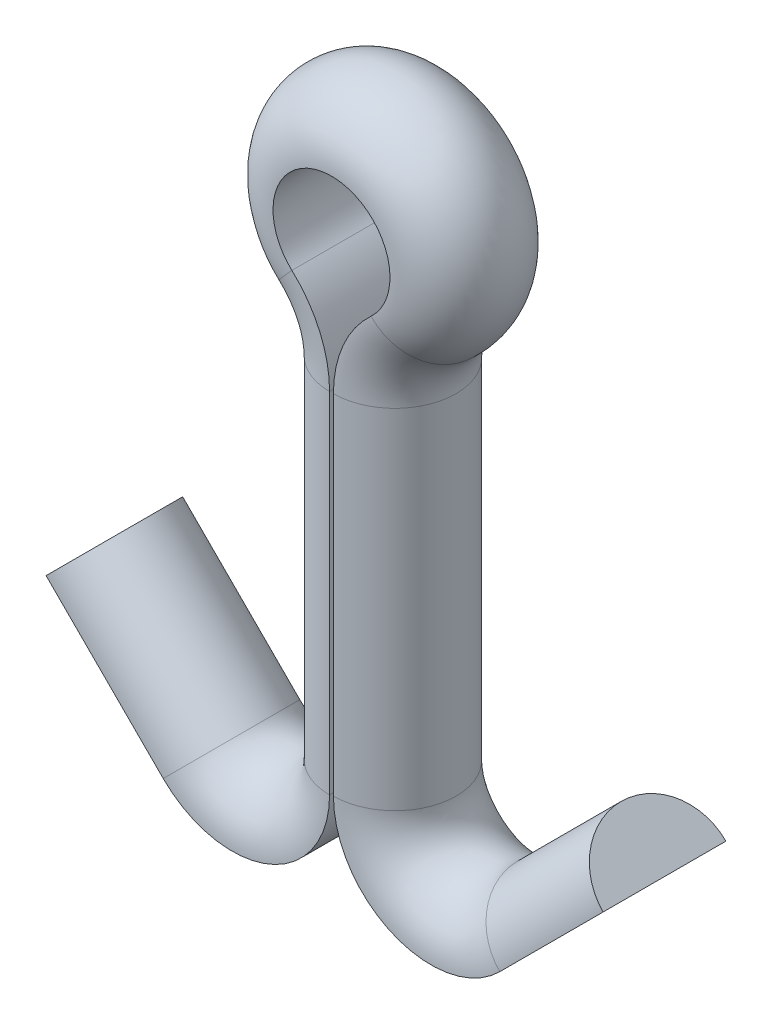
ISO-10303-21;
HEADER;
FILE_DESCRIPTION(('STEP AP214'),'2;1');
FILE_NAME('part.step','',(''),(''),'','','');
FILE_SCHEMA(('AUTOMOTIVE_DESIGN { 1 0 10303 214 1 1 1 1 }'));
ENDSEC;
DATA;
#1=APPLICATION_CONTEXT('core data for automotive mechanical design processes');
#2=APPLICATION_PROTOCOL_DEFINITION('international standard','automotive_design',2000,#1);
#3=PRODUCT_CONTEXT('',#1,'mechanical');
#4=PRODUCT('Part','Part','',(#3));
#5=PRODUCT_RELATED_PRODUCT_CATEGORY('part','',(#4));
#6=PRODUCT_DEFINITION_FORMATION('','',#4);
#7=PRODUCT_DEFINITION_CONTEXT('part definition',#1,'design');
#8=PRODUCT_DEFINITION('design','',#6,#7);
#9=PRODUCT_DEFINITION_SHAPE('','',#8);
#10=(LENGTH_UNIT() NAMED_UNIT(*) SI_UNIT(.MILLI.,.METRE.));
#11=(NAMED_UNIT(*) PLANE_ANGLE_UNIT() SI_UNIT($,.RADIAN.));
#12=(NAMED_UNIT(*) SI_UNIT($,.STERADIAN.) SOLID_ANGLE_UNIT());
#13=UNCERTAINTY_MEASURE_WITH_UNIT(LENGTH_MEASURE(1.E-05),#10,'distance_accuracy_value','');
#14=(GEOMETRIC_REPRESENTATION_CONTEXT(3) GLOBAL_UNCERTAINTY_ASSIGNED_CONTEXT((#13)) GLOBAL_UNIT_ASSIGNED_CONTEXT((#10,
#11,#12)) REPRESENTATION_CONTEXT('',''));
#15=CARTESIAN_POINT('',(0.,0.,0.));
#16=DIRECTION('',(0.,0.,1.));
#17=DIRECTION('',(1.,0.,0.));
#18=AXIS2_PLACEMENT_3D('',#15,#16,#17);
#19=CARTESIAN_POINT('',(-2.19302561210693,-7.1337256121069,0.8001));
#20=DIRECTION('',(0.707106781186551,0.707106781186544,0.));
#21=DIRECTION('',(-0.707106781186544,0.707106781186551,0.));
#22=AXIS2_PLACEMENT_3D('',#19,#20,#21);
#23=PLANE('',#22);
#24=DIRECTION('',(0.,0.,-1.));
#25=VECTOR('',#24,1.);
#26=CARTESIAN_POINT('',(-2.19302561210693,-7.1337256121069,0.8001));
#27=LINE('',#26,#25);
#28=CARTESIAN_POINT('',(-2.19302561210693,-7.1337256121069,0.8001));
#29=VERTEX_POINT('',#28);
#30=CARTESIAN_POINT('',(-2.19302561210693,-7.1337256121069,-0.8001));
#31=VERTEX_POINT('',#30);
#32=EDGE_CURVE('E198',#29,#31,#27,.T.);
#33=ORIENTED_EDGE('',*,*,#32,.F.);
#34=DIRECTION('',(-0.707106781186544,0.707106781186551,0.));
#35=VECTOR('',#34,1.);
#36=CARTESIAN_POINT('',(-2.19302561210693,-7.1337256121069,0.8001));
#37=LINE('',#36,#35);
#38=CARTESIAN_POINT('',(-3.71966915268867,-5.60708207152514,0.8001));
#39=VERTEX_POINT('',#38);
#40=EDGE_CURVE('E38',#29,#39,#37,.T.);
#41=ORIENTED_EDGE('',*,*,#40,.T.);
#42=DIRECTION('',(0.,0.,-1.));
#43=VECTOR('',#42,1.);
#44=CARTESIAN_POINT('',(-3.71966915268867,-5.60708207152514,0.8001));
#45=LINE('',#44,#43);
#46=CARTESIAN_POINT('',(-3.71966915268867,-5.60708207152514,-0.8001));
#47=VERTEX_POINT('',#46);
#48=EDGE_CURVE('E45',#39,#47,#45,.T.);
#49=ORIENTED_EDGE('',*,*,#48,.T.);
#50=DIRECTION('',(-0.707106781186544,0.707106781186551,0.));
#51=VECTOR('',#50,1.);
#52=CARTESIAN_POINT('',(-2.19302561210693,-7.1337256121069,-0.8001));
#53=LINE('',#52,#51);
#54=EDGE_CURVE('E11',#31,#47,#53,.T.);
#55=ORIENTED_EDGE('',*,*,#54,.F.);
#56=EDGE_LOOP('',(#33,#41,#49,#55));
#57=FACE_BOUND('',#56,.T.);
#58=ADVANCED_FACE('F31',(#57),#23,.F.);
#59=CARTESIAN_POINT('',(-2.19302561210693,-7.1337256121069,0.));
#60=DIRECTION('',(-0.707106781186544,0.707106781186551,0.));
#61=DIRECTION('',(-0.707106781186551,-0.707106781186544,0.));
#62=AXIS2_PLACEMENT_3D('',#59,#60,#61);
#63=CYLINDRICAL_SURFACE('',#62,0.8001);
#64=CARTESIAN_POINT('',(-2.19302561210693,-7.1337256121069,0.));
#65=DIRECTION('',(-0.707106781186554,0.707106781186541,0.));
#66=DIRECTION('',(-0.707106781186541,-0.707106781186554,0.));
#67=AXIS2_PLACEMENT_3D('',#64,#65,#66);
#68=CIRCLE('',#67,0.8001);
#69=EDGE_CURVE('E195',#29,#31,#68,.T.);
#70=ORIENTED_EDGE('',*,*,#69,.T.);
#71=ORIENTED_EDGE('',*,*,#54,.T.);
#72=CARTESIAN_POINT('',(-3.71966915268868,-5.60708207152514,0.));
#73=DIRECTION('',(-0.707106781186554,0.707106781186541,0.));
#74=DIRECTION('',(-0.707106781186541,-0.707106781186554,0.));
#75=AXIS2_PLACEMENT_3D('',#72,#73,#74);
#76=CIRCLE('',#75,0.8001);
#77=EDGE_CURVE('E51',#39,#47,#76,.T.);
#78=ORIENTED_EDGE('',*,*,#77,.F.);
#79=ORIENTED_EDGE('',*,*,#40,.F.);
#80=EDGE_LOOP('',(#70,#71,#78,#79));
#81=FACE_BOUND('',#80,.T.);
#82=ADVANCED_FACE('F210',(#81),#63,.T.);
#83=CARTESIAN_POINT('',(-1.295,-6.2357,0.));
#84=DIRECTION('',(0.,0.,-1.));
#85=DIRECTION('',(-1.,0.,0.));
#86=AXIS2_PLACEMENT_3D('',#83,#84,#85);
#87=CYLINDRICAL_SURFACE('',#86,1.27);
#88=DIRECTION('',(0.,0.,-1.));
#89=VECTOR('',#88,1.);
#90=CARTESIAN_POINT('',(-0.0250000000000011,-6.23570000000001,0.8001));
#91=LINE('',#90,#89);
#92=CARTESIAN_POINT('',(-0.0250000000000011,-6.23570000000001,0.8001));
#93=VERTEX_POINT('',#92);
#94=CARTESIAN_POINT('',(-0.0250000000000011,-6.23570000000001,-0.8001));
#95=VERTEX_POINT('',#94);
#96=EDGE_CURVE('E186',#93,#95,#91,.T.);
#97=ORIENTED_EDGE('',*,*,#96,.F.);
#98=CARTESIAN_POINT('',(-1.295,-6.2357,0.8001));
#99=DIRECTION('',(0.,0.,-1.));
#100=DIRECTION('',(-1.,0.,0.));
#101=AXIS2_PLACEMENT_3D('',#98,#99,#100);
#102=CIRCLE('',#101,1.27);
#103=EDGE_CURVE('E201',#93,#29,#102,.T.);
#104=ORIENTED_EDGE('',*,*,#103,.T.);
#105=ORIENTED_EDGE('',*,*,#32,.T.);
#106=CARTESIAN_POINT('',(-1.295,-6.2357,-0.8001));
#107=DIRECTION('',(0.,0.,-1.));
#108=DIRECTION('',(-1.,0.,0.));
#109=AXIS2_PLACEMENT_3D('',#106,#107,#108);
#110=CIRCLE('',#109,1.27);
#111=EDGE_CURVE('E204',#95,#31,#110,.T.);
#112=ORIENTED_EDGE('',*,*,#111,.F.);
#113=EDGE_LOOP('',(#97,#104,#105,#112));
#114=FACE_BOUND('',#113,.T.);
#115=ADVANCED_FACE('F214',(#114),#87,.T.);
#116=CARTESIAN_POINT('',(-1.295,-6.2357,0.));
#117=DIRECTION('',(0.,0.,-1.));
#118=DIRECTION('',(-1.,0.,0.));
#119=AXIS2_PLACEMENT_3D('',#116,#117,#118);
#120=TOROIDAL_SURFACE('',#119,1.27,0.8001);
#121=CARTESIAN_POINT('',(-0.0250000000000009,-6.23570000000001,0.));
#122=DIRECTION('',(0.,-1.,0.));
#123=DIRECTION('',(1.,0.,0.));
#124=AXIS2_PLACEMENT_3D('',#121,#122,#123);
#125=CIRCLE('',#124,0.8001);
#126=EDGE_CURVE('E183',#93,#95,#125,.T.);
#127=ORIENTED_EDGE('',*,*,#126,.T.);
#128=ORIENTED_EDGE('',*,*,#111,.T.);
#129=ORIENTED_EDGE('',*,*,#69,.F.);
#130=ORIENTED_EDGE('',*,*,#103,.F.);
#131=EDGE_LOOP('',(#127,#128,#129,#130));
#132=FACE_BOUND('',#131,.T.);
#133=ADVANCED_FACE('F215',(#132),#120,.T.);
#134=CARTESIAN_POINT('',(-0.0250000000000005,-1.68118856765088,0.8001));
#135=DIRECTION('',(-1.,0.,0.));
#136=DIRECTION('',(0.,-1.,0.));
#137=AXIS2_PLACEMENT_3D('',#134,#135,#136);
#138=PLANE('',#137);
#139=DIRECTION('',(0.,0.,-1.));
#140=VECTOR('',#139,1.);
#141=CARTESIAN_POINT('',(-0.0250000000000005,-1.68118856765088,0.8001));
#142=LINE('',#141,#140);
#143=CARTESIAN_POINT('',(-0.0250000000000005,-1.68118856765088,0.8001));
#144=VERTEX_POINT('',#143);
#145=CARTESIAN_POINT('',(-0.0250000000000005,-1.68118856765088,-0.8001));
#146=VERTEX_POINT('',#145);
#147=EDGE_CURVE('E174',#144,#146,#142,.T.);
#148=ORIENTED_EDGE('',*,*,#147,.F.);
#149=DIRECTION('',(0.,-1.,0.));
#150=VECTOR('',#149,1.);
#151=CARTESIAN_POINT('',(-0.0250000000000005,-1.68118856765088,0.8001));
#152=LINE('',#151,#150);
#153=EDGE_CURVE('E189',#144,#93,#152,.T.);
#154=ORIENTED_EDGE('',*,*,#153,.T.);
#155=ORIENTED_EDGE('',*,*,#96,.T.);
#156=DIRECTION('',(0.,-1.,0.));
#157=VECTOR('',#156,1.);
#158=CARTESIAN_POINT('',(-0.0250000000000005,-1.68118856765088,-0.8001));
#159=LINE('',#158,#157);
#160=EDGE_CURVE('E192',#146,#95,#159,.T.);
#161=ORIENTED_EDGE('',*,*,#160,.F.);
#162=EDGE_LOOP('',(#148,#154,#155,#161));
#163=FACE_BOUND('',#162,.T.);
#164=ADVANCED_FACE('F220',(#163),#138,.F.);
#165=CARTESIAN_POINT('',(-0.0250000000000003,-1.68118856765088,0.));
#166=DIRECTION('',(0.,-1.,0.));
#167=DIRECTION('',(1.,0.,0.));
#168=AXIS2_PLACEMENT_3D('',#165,#166,#167);
#169=CYLINDRICAL_SURFACE('',#168,0.8001);
#170=CARTESIAN_POINT('',(-0.0250000000000003,-1.68118856765088,0.));
#171=DIRECTION('',(0.,-1.,0.));
#172=DIRECTION('',(1.,0.,0.));
#173=AXIS2_PLACEMENT_3D('',#170,#171,#172);
#174=CIRCLE('',#173,0.8001);
#175=EDGE_CURVE('E171',#144,#146,#174,.T.);
#176=ORIENTED_EDGE('',*,*,#175,.T.);
#177=ORIENTED_EDGE('',*,*,#160,.T.);
#178=ORIENTED_EDGE('',*,*,#126,.F.);
#179=ORIENTED_EDGE('',*,*,#153,.F.);
#180=EDGE_LOOP('',(#176,#177,#178,#179));
#181=FACE_BOUND('',#180,.T.);
#182=ADVANCED_FACE('F221',(#181),#169,.T.);
#183=CARTESIAN_POINT('',(-1.549,-1.68118856765087,0.));
#184=DIRECTION('',(0.,0.,-1.));
#185=DIRECTION('',(-1.,0.,0.));
#186=AXIS2_PLACEMENT_3D('',#183,#184,#185);
#187=CYLINDRICAL_SURFACE('',#186,1.524);
#188=DIRECTION('',(0.,0.,-1.));
#189=VECTOR('',#188,1.);
#190=CARTESIAN_POINT('',(-0.516333333333326,-0.560396189216966,0.8001));
#191=LINE('',#190,#189);
#192=CARTESIAN_POINT('',(-0.516333333333326,-0.560396189216966,0.8001));
#193=VERTEX_POINT('',#192);
#194=CARTESIAN_POINT('',(-0.516333333333326,-0.560396189216966,-0.8001));
#195=VERTEX_POINT('',#194);
#196=EDGE_CURVE('E162',#193,#195,#191,.T.);
#197=ORIENTED_EDGE('',*,*,#196,.F.);
#198=CARTESIAN_POINT('',(-1.549,-1.68118856765087,0.8001));
#199=DIRECTION('',(0.,0.,-1.));
#200=DIRECTION('',(-1.,0.,0.));
#201=AXIS2_PLACEMENT_3D('',#198,#199,#200);
#202=CIRCLE('',#201,1.524);
#203=EDGE_CURVE('E177',#193,#144,#202,.T.);
#204=ORIENTED_EDGE('',*,*,#203,.T.);
#205=ORIENTED_EDGE('',*,*,#147,.T.);
#206=CARTESIAN_POINT('',(-1.549,-1.68118856765087,-0.8001));
#207=DIRECTION('',(0.,0.,-1.));
#208=DIRECTION('',(-1.,0.,0.));
#209=AXIS2_PLACEMENT_3D('',#206,#207,#208);
#210=CIRCLE('',#209,1.524);
#211=EDGE_CURVE('E180',#195,#146,#210,.T.);
#212=ORIENTED_EDGE('',*,*,#211,.F.);
#213=EDGE_LOOP('',(#197,#204,#205,#212));
#214=FACE_BOUND('',#213,.T.);
#215=ADVANCED_FACE('F226',(#214),#187,.T.);
#216=CARTESIAN_POINT('',(-1.549,-1.68118856765087,0.));
#217=DIRECTION('',(0.,0.,-1.));
#218=DIRECTION('',(-1.,0.,0.));
#219=AXIS2_PLACEMENT_3D('',#216,#217,#218);
#220=TOROIDAL_SURFACE('',#219,1.524,0.8001);
#221=CARTESIAN_POINT('',(-0.516333333333326,-0.560396189216965,0.));
#222=DIRECTION('',(0.735428069838538,-0.677602799650033,0.));
#223=DIRECTION('',(0.677602799650033,0.735428069838538,0.));
#224=AXIS2_PLACEMENT_3D('',#221,#222,#223);
#225=CIRCLE('',#224,0.8001);
#226=EDGE_CURVE('E159',#193,#195,#225,.T.);
#227=ORIENTED_EDGE('',*,*,#226,.T.);
#228=ORIENTED_EDGE('',*,*,#211,.T.);
#229=ORIENTED_EDGE('',*,*,#175,.F.);
#230=ORIENTED_EDGE('',*,*,#203,.F.);
#231=EDGE_LOOP('',(#227,#228,#229,#230));
#232=FACE_BOUND('',#231,.T.);
#233=ADVANCED_FACE('F227',(#232),#220,.T.);
#234=CARTESIAN_POINT('',(0.,0.,0.));
#235=DIRECTION('',(0.,0.,1.));
#236=DIRECTION('',(1.,0.,0.));
#237=AXIS2_PLACEMENT_3D('',#234,#235,#236);
#238=CYLINDRICAL_SURFACE('',#237,0.762);
#239=DIRECTION('',(0.,0.,-1.));
#240=VECTOR('',#239,1.);
#241=CARTESIAN_POINT('',(0.516333333333333,-0.560396189216959,0.8001));
#242=LINE('',#241,#240);
#243=CARTESIAN_POINT('',(0.516333333333333,-0.560396189216959,0.8001));
#244=VERTEX_POINT('',#243);
#245=CARTESIAN_POINT('',(0.516333333333333,-0.560396189216959,-0.8001));
#246=VERTEX_POINT('',#245);
#247=EDGE_CURVE('E150',#244,#246,#242,.T.);
#248=ORIENTED_EDGE('',*,*,#247,.F.);
#249=CARTESIAN_POINT('',(0.,0.,0.8001));
#250=DIRECTION('',(0.,0.,1.));
#251=DIRECTION('',(1.,0.,0.));
#252=AXIS2_PLACEMENT_3D('',#249,#250,#251);
#253=CIRCLE('',#252,0.762);
#254=EDGE_CURVE('E165',#244,#193,#253,.T.);
#255=ORIENTED_EDGE('',*,*,#254,.T.);
#256=ORIENTED_EDGE('',*,*,#196,.T.);
#257=CARTESIAN_POINT('',(0.,0.,-0.8001));
#258=DIRECTION('',(0.,0.,1.));
#259=DIRECTION('',(1.,0.,0.));
#260=AXIS2_PLACEMENT_3D('',#257,#258,#259);
#261=CIRCLE('',#260,0.762);
#262=EDGE_CURVE('E168',#246,#195,#261,.T.);
#263=ORIENTED_EDGE('',*,*,#262,.F.);
#264=EDGE_LOOP('',(#248,#255,#256,#263));
#265=FACE_BOUND('',#264,.T.);
#266=ADVANCED_FACE('F232',(#265),#238,.F.);
#267=CARTESIAN_POINT('',(0.,0.,0.));
#268=DIRECTION('',(0.,0.,1.));
#269=DIRECTION('',(1.,0.,0.));
#270=AXIS2_PLACEMENT_3D('',#267,#268,#269);
#271=DEGENERATE_TOROIDAL_SURFACE('',#270,0.762,0.8001,.T.);
#272=CARTESIAN_POINT('',(0.516333333333333,-0.560396189216959,0.));
#273=DIRECTION('',(0.735428069838528,0.677602799650044,0.));
#274=DIRECTION('',(-0.677602799650044,0.735428069838528,0.));
#275=AXIS2_PLACEMENT_3D('',#272,#273,#274);
#276=CIRCLE('',#275,0.8001);
#277=EDGE_CURVE('E127',#244,#246,#276,.T.);
#278=ORIENTED_EDGE('',*,*,#277,.T.);
#279=ORIENTED_EDGE('',*,*,#262,.T.);
#280=ORIENTED_EDGE('',*,*,#226,.F.);
#281=ORIENTED_EDGE('',*,*,#254,.F.);
#282=EDGE_LOOP('',(#278,#279,#280,#281));
#283=FACE_BOUND('',#282,.T.);
#284=ADVANCED_FACE('F233',(#283),#271,.T.);
#285=CARTESIAN_POINT('',(1.549,-1.68118856765087,0.));
#286=DIRECTION('',(0.,0.,-1.));
#287=DIRECTION('',(-1.,0.,0.));
#288=AXIS2_PLACEMENT_3D('',#285,#286,#287);
#289=CYLINDRICAL_SURFACE('',#288,1.524);
#290=DIRECTION('',(0.,0.,-1.));
#291=VECTOR('',#290,1.);
#292=CARTESIAN_POINT('',(0.0250000000000002,-1.68118856765088,0.8001));
#293=LINE('',#292,#291);
#294=CARTESIAN_POINT('',(0.0250000000000002,-1.68118856765088,0.8001));
#295=VERTEX_POINT('',#294);
#296=CARTESIAN_POINT('',(0.0250000000000002,-1.68118856765088,-0.8001));
#297=VERTEX_POINT('',#296);
#298=EDGE_CURVE('E126',#295,#297,#293,.T.);
#299=ORIENTED_EDGE('',*,*,#298,.F.);
#300=CARTESIAN_POINT('',(1.549,-1.68118856765087,0.8001));
#301=DIRECTION('',(0.,0.,-1.));
#302=DIRECTION('',(-1.,0.,0.));
#303=AXIS2_PLACEMENT_3D('',#300,#301,#302);
#304=CIRCLE('',#303,1.524);
#305=EDGE_CURVE('E153',#295,#244,#304,.T.);
#306=ORIENTED_EDGE('',*,*,#305,.T.);
#307=ORIENTED_EDGE('',*,*,#247,.T.);
#308=CARTESIAN_POINT('',(1.549,-1.68118856765087,-0.8001));
#309=DIRECTION('',(0.,0.,-1.));
#310=DIRECTION('',(-1.,0.,0.));
#311=AXIS2_PLACEMENT_3D('',#308,#309,#310);
#312=CIRCLE('',#311,1.524);
#313=EDGE_CURVE('E156',#297,#246,#312,.T.);
#314=ORIENTED_EDGE('',*,*,#313,.F.);
#315=EDGE_LOOP('',(#299,#306,#307,#314));
#316=FACE_BOUND('',#315,.T.);
#317=ADVANCED_FACE('F237',(#316),#289,.T.);
#318=CARTESIAN_POINT('',(1.549,-1.68118856765087,0.));
#319=DIRECTION('',(0.,0.,-1.));
#320=DIRECTION('',(-1.,0.,0.));
#321=AXIS2_PLACEMENT_3D('',#318,#319,#320);
#322=TOROIDAL_SURFACE('',#321,1.524,0.8001);
#323=CARTESIAN_POINT('',(0.0250000000000001,-1.68118856765088,0.));
#324=DIRECTION('',(0.,1.,0.));
#325=DIRECTION('',(-1.,0.,0.));
#326=AXIS2_PLACEMENT_3D('',#323,#324,#325);
#327=CIRCLE('',#326,0.8001);
#328=EDGE_CURVE('E141',#295,#297,#327,.T.);
#329=ORIENTED_EDGE('',*,*,#328,.T.);
#330=ORIENTED_EDGE('',*,*,#313,.T.);
#331=ORIENTED_EDGE('',*,*,#277,.F.);
#332=ORIENTED_EDGE('',*,*,#305,.F.);
#333=EDGE_LOOP('',(#329,#330,#331,#332));
#334=FACE_BOUND('',#333,.T.);
#335=ADVANCED_FACE('F238',(#334),#322,.T.);
#336=CARTESIAN_POINT('',(0.0250000000000001,-1.68118856765088,0.));
#337=DIRECTION('',(0.,-1.,0.));
#338=DIRECTION('',(1.,0.,0.));
#339=AXIS2_PLACEMENT_3D('',#336,#337,#338);
#340=CYLINDRICAL_SURFACE('',#339,0.8001);
#341=CARTESIAN_POINT('',(0.0250000000000007,-6.223,0.));
#342=DIRECTION('',(0.,1.,0.));
#343=DIRECTION('',(-1.,0.,0.));
#344=AXIS2_PLACEMENT_3D('',#341,#342,#343);
#345=CIRCLE('',#344,0.8001);
#346=CARTESIAN_POINT('',(0.0250000000000009,-6.223,0.8001));
#347=VERTEX_POINT('',#346);
#348=CARTESIAN_POINT('',(0.0250000000000006,-6.223,-0.8001));
#349=VERTEX_POINT('',#348);
#350=EDGE_CURVE('E106',#347,#349,#345,.T.);
#351=ORIENTED_EDGE('',*,*,#350,.T.);
#352=DIRECTION('',(0.,-1.,0.));
#353=VECTOR('',#352,1.);
#354=CARTESIAN_POINT('',(0.0250000000000002,-1.68118856765088,-0.8001));
#355=LINE('',#354,#353);
#356=EDGE_CURVE('E110',#297,#349,#355,.T.);
#357=ORIENTED_EDGE('',*,*,#356,.F.);
#358=ORIENTED_EDGE('',*,*,#328,.F.);
#359=DIRECTION('',(0.,-1.,0.));
#360=VECTOR('',#359,1.);
#361=CARTESIAN_POINT('',(0.0250000000000002,-1.68118856765088,0.8001));
#362=LINE('',#361,#360);
#363=EDGE_CURVE('E113',#295,#347,#362,.T.);
#364=ORIENTED_EDGE('',*,*,#363,.T.);
#365=EDGE_LOOP('',(#351,#357,#358,#364));
#366=FACE_BOUND('',#365,.T.);
#367=ADVANCED_FACE('F108',(#366),#340,.T.);
#368=CARTESIAN_POINT('',(0.0250000000000002,-1.68118856765088,0.8001));
#369=DIRECTION('',(-1.,0.,0.));
#370=DIRECTION('',(0.,-1.,0.));
#371=AXIS2_PLACEMENT_3D('',#368,#369,#370);
#372=PLANE('',#371);
#373=DIRECTION('',(0.,0.,-1.));
#374=VECTOR('',#373,1.);
#375=CARTESIAN_POINT('',(0.0250000000000009,-6.223,0.8001));
#376=LINE('',#375,#374);
#377=EDGE_CURVE('E118',#347,#349,#376,.T.);
#378=ORIENTED_EDGE('',*,*,#377,.F.);
#379=ORIENTED_EDGE('',*,*,#363,.F.);
#380=ORIENTED_EDGE('',*,*,#298,.T.);
#381=ORIENTED_EDGE('',*,*,#356,.T.);
#382=EDGE_LOOP('',(#378,#379,#380,#381));
#383=FACE_BOUND('',#382,.T.);
#384=ADVANCED_FACE('F122',(#383),#372,.T.);
#385=CARTESIAN_POINT('',(-3.71966915268868,-5.60708207152514,0.));
#386=DIRECTION('',(-0.707106781186554,0.707106781186541,0.));
#387=DIRECTION('',(-0.707106781186541,-0.707106781186554,0.));
#388=AXIS2_PLACEMENT_3D('',#385,#386,#387);
#389=PLANE('',#388);
#390=ORIENTED_EDGE('',*,*,#77,.T.);
#391=ORIENTED_EDGE('',*,*,#48,.F.);
#392=EDGE_LOOP('',(#390,#391));
#393=FACE_BOUND('',#392,.T.);
#394=ADVANCED_FACE('F299',(#393),#389,.T.);
#395=CARTESIAN_POINT('',(2.19302561210692,-7.12102561210691,0.8001));
#396=DIRECTION('',(0.707106781186551,-0.707106781186544,0.));
#397=DIRECTION('',(0.707106781186544,0.707106781186551,0.));
#398=AXIS2_PLACEMENT_3D('',#395,#396,#397);
#399=PLANE('',#398);
#400=DIRECTION('',(0.,0.,-1.));
#401=VECTOR('',#400,1.);
#402=CARTESIAN_POINT('',(2.19302561210692,-7.12102561210691,0.8001));
#403=LINE('',#402,#401);
#404=CARTESIAN_POINT('',(2.19302561210692,-7.12102561210691,0.8001));
#405=VERTEX_POINT('',#404);
#406=CARTESIAN_POINT('',(2.19302561210692,-7.12102561210691,-0.8001));
#407=VERTEX_POINT('',#406);
#408=EDGE_CURVE('E138',#405,#407,#403,.T.);
#409=ORIENTED_EDGE('',*,*,#408,.T.);
#410=DIRECTION('',(0.707106781186544,0.707106781186551,0.));
#411=VECTOR('',#410,1.);
#412=CARTESIAN_POINT('',(2.19302561210692,-7.12102561210691,-0.8001));
#413=LINE('',#412,#411);
#414=CARTESIAN_POINT('',(3.54006403026729,-5.77398719394653,-0.8001));
#415=VERTEX_POINT('',#414);
#416=EDGE_CURVE('E242',#407,#415,#413,.T.);
#417=ORIENTED_EDGE('',*,*,#416,.T.);
#418=DIRECTION('',(0.,0.,-1.));
#419=VECTOR('',#418,1.);
#420=CARTESIAN_POINT('',(3.54006403026729,-5.77398719394653,0.8001));
#421=LINE('',#420,#419);
#422=CARTESIAN_POINT('',(3.54006403026729,-5.77398719394653,0.8001));
#423=VERTEX_POINT('',#422);
#424=EDGE_CURVE('E245',#423,#415,#421,.T.);
#425=ORIENTED_EDGE('',*,*,#424,.F.);
#426=DIRECTION('',(0.707106781186544,0.707106781186551,0.));
#427=VECTOR('',#426,1.);
#428=CARTESIAN_POINT('',(2.19302561210692,-7.12102561210691,0.8001));
#429=LINE('',#428,#427);
#430=EDGE_CURVE('E119',#405,#423,#429,.T.);
#431=ORIENTED_EDGE('',*,*,#430,.F.);
#432=EDGE_LOOP('',(#409,#417,#425,#431));
#433=FACE_BOUND('',#432,.T.);
#434=ADVANCED_FACE('F257',(#433),#399,.T.);
#435=CARTESIAN_POINT('',(2.19302561210692,-7.12102561210691,0.));
#436=DIRECTION('',(0.707106781186544,0.707106781186551,0.));
#437=DIRECTION('',(-0.707106781186551,0.707106781186544,0.));
#438=AXIS2_PLACEMENT_3D('',#435,#436,#437);
#439=CYLINDRICAL_SURFACE('',#438,0.8001);
#440=CARTESIAN_POINT('',(2.19302561210692,-7.12102561210691,0.));
#441=DIRECTION('',(0.707106781186544,0.707106781186551,0.));
#442=DIRECTION('',(-0.707106781186551,0.707106781186544,0.));
#443=AXIS2_PLACEMENT_3D('',#440,#441,#442);
#444=CIRCLE('',#443,0.8001);
#445=EDGE_CURVE('E134',#407,#405,#444,.T.);
#446=ORIENTED_EDGE('',*,*,#445,.T.);
#447=ORIENTED_EDGE('',*,*,#430,.T.);
#448=CARTESIAN_POINT('',(3.54006403026729,-5.77398719394653,0.));
#449=DIRECTION('',(0.707106781186544,0.707106781186551,0.));
#450=DIRECTION('',(-0.707106781186551,0.707106781186544,0.));
#451=AXIS2_PLACEMENT_3D('',#448,#449,#450);
#452=CIRCLE('',#451,0.8001);
#453=EDGE_CURVE('E248',#415,#423,#452,.T.);
#454=ORIENTED_EDGE('',*,*,#453,.F.);
#455=ORIENTED_EDGE('',*,*,#416,.F.);
#456=EDGE_LOOP('',(#446,#447,#454,#455));
#457=FACE_BOUND('',#456,.T.);
#458=ADVANCED_FACE('F255',(#457),#439,.T.);
#459=CARTESIAN_POINT('',(1.295,-6.223,0.));
#460=DIRECTION('',(0.,0.,-1.));
#461=DIRECTION('',(-1.,0.,0.));
#462=AXIS2_PLACEMENT_3D('',#459,#460,#461);
#463=TOROIDAL_SURFACE('',#462,1.27,0.8001);
#464=CARTESIAN_POINT('',(1.295,-6.223,0.8001));
#465=DIRECTION('',(0.,0.,-1.));
#466=DIRECTION('',(-1.,0.,0.));
#467=AXIS2_PLACEMENT_3D('',#464,#465,#466);
#468=CIRCLE('',#467,1.27);
#469=EDGE_CURVE('E137',#405,#347,#468,.T.);
#470=ORIENTED_EDGE('',*,*,#469,.F.);
#471=ORIENTED_EDGE('',*,*,#445,.F.);
#472=CARTESIAN_POINT('',(1.295,-6.223,-0.8001));
#473=DIRECTION('',(0.,0.,-1.));
#474=DIRECTION('',(-1.,0.,0.));
#475=AXIS2_PLACEMENT_3D('',#472,#473,#474);
#476=CIRCLE('',#475,1.27);
#477=EDGE_CURVE('E131',#407,#349,#476,.T.);
#478=ORIENTED_EDGE('',*,*,#477,.T.);
#479=ORIENTED_EDGE('',*,*,#350,.F.);
#480=EDGE_LOOP('',(#470,#471,#478,#479));
#481=FACE_BOUND('',#480,.T.);
#482=ADVANCED_FACE('F132',(#481),#463,.T.);
#483=CARTESIAN_POINT('',(1.295,-6.223,0.));
#484=DIRECTION('',(0.,0.,-1.));
#485=DIRECTION('',(-1.,0.,0.));
#486=AXIS2_PLACEMENT_3D('',#483,#484,#485);
#487=CYLINDRICAL_SURFACE('',#486,1.27);
#488=ORIENTED_EDGE('',*,*,#408,.F.);
#489=ORIENTED_EDGE('',*,*,#469,.T.);
#490=ORIENTED_EDGE('',*,*,#377,.T.);
#491=ORIENTED_EDGE('',*,*,#477,.F.);
#492=EDGE_LOOP('',(#488,#489,#490,#491));
#493=FACE_BOUND('',#492,.T.);
#494=ADVANCED_FACE('F140',(#493),#487,.T.);
#495=CARTESIAN_POINT('',(3.54006403026729,-5.77398719394653,0.));
#496=DIRECTION('',(0.707106781186544,0.707106781186551,0.));
#497=DIRECTION('',(-0.707106781186551,0.707106781186544,0.));
#498=AXIS2_PLACEMENT_3D('',#495,#496,#497);
#499=PLANE('',#498);
#500=ORIENTED_EDGE('',*,*,#453,.T.);
#501=ORIENTED_EDGE('',*,*,#424,.T.);
#502=EDGE_LOOP('',(#500,#501));
#503=FACE_BOUND('',#502,.T.);
#504=ADVANCED_FACE('F259',(#503),#499,.T.);
#505=CLOSED_SHELL('',(#58,#82,#115,#133,#164,#182,#215,#233,#266,#284,#317,#335,#367,#384,#394,
#434,#458,#482,#494,#504));
#506=MANIFOLD_SOLID_BREP('B2',#505);
#507=ADVANCED_BREP_SHAPE_REPRESENTATION('',(#18,#506),#14);
#508=SHAPE_DEFINITION_REPRESENTATION(#9,#507);
ENDSEC;
END-ISO-10303-21;
